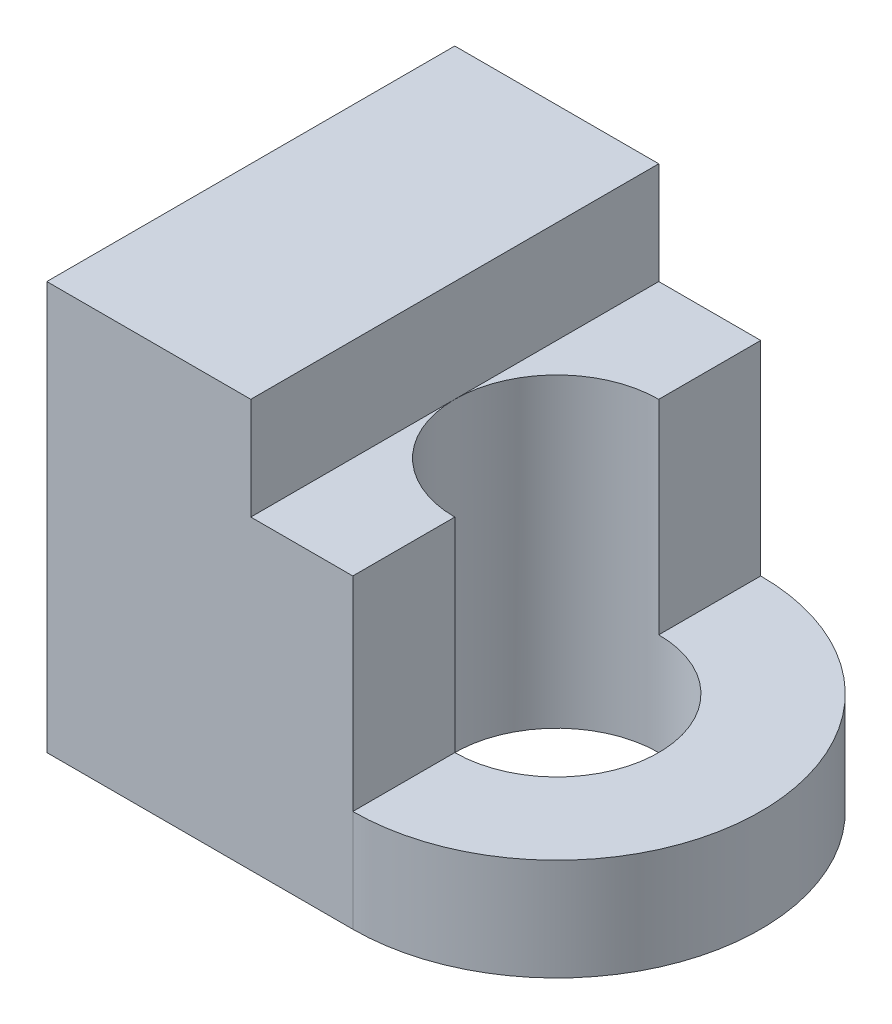
ISO-10303-21;
HEADER;
FILE_DESCRIPTION(('STEP AP214'),'2;1');
FILE_NAME('part.step','',(''),(''),'','','');
FILE_SCHEMA(('AUTOMOTIVE_DESIGN { 1 0 10303 214 1 1 1 1 }'));
ENDSEC;
DATA;
#1=APPLICATION_CONTEXT('core data for automotive mechanical design processes');
#2=APPLICATION_PROTOCOL_DEFINITION('international standard','automotive_design',2000,#1);
#3=PRODUCT_CONTEXT('',#1,'mechanical');
#4=PRODUCT('Part','Part','',(#3));
#5=PRODUCT_RELATED_PRODUCT_CATEGORY('part','',(#4));
#6=PRODUCT_DEFINITION_FORMATION('','',#4);
#7=PRODUCT_DEFINITION_CONTEXT('part definition',#1,'design');
#8=PRODUCT_DEFINITION('design','',#6,#7);
#9=PRODUCT_DEFINITION_SHAPE('','',#8);
#10=(LENGTH_UNIT() NAMED_UNIT(*) SI_UNIT(.MILLI.,.METRE.));
#11=(NAMED_UNIT(*) PLANE_ANGLE_UNIT() SI_UNIT($,.RADIAN.));
#12=(NAMED_UNIT(*) SI_UNIT($,.STERADIAN.) SOLID_ANGLE_UNIT());
#13=UNCERTAINTY_MEASURE_WITH_UNIT(LENGTH_MEASURE(1.E-05),#10,'distance_accuracy_value','');
#14=(GEOMETRIC_REPRESENTATION_CONTEXT(3) GLOBAL_UNCERTAINTY_ASSIGNED_CONTEXT((#13)) GLOBAL_UNIT_ASSIGNED_CONTEXT((#10,
#11,#12)) REPRESENTATION_CONTEXT('',''));
#15=CARTESIAN_POINT('',(0.,0.,0.));
#16=DIRECTION('',(0.,0.,1.));
#17=DIRECTION('',(1.,0.,0.));
#18=AXIS2_PLACEMENT_3D('',#15,#16,#17);
#19=CARTESIAN_POINT('',(0.,15.,0.));
#20=DIRECTION('',(0.,1.,0.));
#21=DIRECTION('',(0.,0.,1.));
#22=AXIS2_PLACEMENT_3D('',#19,#20,#21);
#23=PLANE('',#22);
#24=DIRECTION('',(-1.,0.,0.));
#25=VECTOR('',#24,1.);
#26=CARTESIAN_POINT('',(0.,15.,-10.));
#27=LINE('',#26,#25);
#28=CARTESIAN_POINT('',(0.,15.,-10.));
#29=VERTEX_POINT('',#28);
#30=CARTESIAN_POINT('',(-5.,15.,-10.));
#31=VERTEX_POINT('',#30);
#32=EDGE_CURVE('E75',#29,#31,#27,.T.);
#33=ORIENTED_EDGE('',*,*,#32,.T.);
#34=DIRECTION('',(0.,0.,1.));
#35=VECTOR('',#34,1.);
#36=CARTESIAN_POINT('',(-5.,15.,0.));
#37=LINE('',#36,#35);
#38=CARTESIAN_POINT('',(-5.,15.,0.));
#39=VERTEX_POINT('',#38);
#40=EDGE_CURVE('E12',#31,#39,#37,.T.);
#41=ORIENTED_EDGE('',*,*,#40,.T.);
#42=CARTESIAN_POINT('',(0.,15.,0.));
#43=DIRECTION('',(0.,1.,0.));
#44=DIRECTION('',(0.,0.,1.));
#45=AXIS2_PLACEMENT_3D('',#42,#43,#44);
#46=CIRCLE('',#45,5.);
#47=CARTESIAN_POINT('',(0.,15.,-5.));
#48=VERTEX_POINT('',#47);
#49=EDGE_CURVE('E162',#48,#39,#46,.T.);
#50=ORIENTED_EDGE('',*,*,#49,.F.);
#51=DIRECTION('',(0.,0.,-1.));
#52=VECTOR('',#51,1.);
#53=CARTESIAN_POINT('',(0.,15.,0.));
#54=LINE('',#53,#52);
#55=EDGE_CURVE('E165',#48,#29,#54,.T.);
#56=ORIENTED_EDGE('',*,*,#55,.T.);
#57=EDGE_LOOP('',(#33,#41,#50,#56));
#58=FACE_BOUND('',#57,.T.);
#59=ADVANCED_FACE('F54',(#58),#23,.T.);
#60=CARTESIAN_POINT('',(0.,15.,5.));
#61=VERTEX_POINT('',#60);
#62=EDGE_CURVE('E161',#39,#61,#46,.T.);
#63=ORIENTED_EDGE('',*,*,#62,.F.);
#64=CARTESIAN_POINT('',(-5.,15.,10.));
#65=VERTEX_POINT('',#64);
#66=EDGE_CURVE('E58',#39,#65,#37,.T.);
#67=ORIENTED_EDGE('',*,*,#66,.T.);
#68=DIRECTION('',(-1.,0.,0.));
#69=VECTOR('',#68,1.);
#70=CARTESIAN_POINT('',(0.,15.,10.));
#71=LINE('',#70,#69);
#72=CARTESIAN_POINT('',(0.,15.,10.));
#73=VERTEX_POINT('',#72);
#74=EDGE_CURVE('E168',#73,#65,#71,.T.);
#75=ORIENTED_EDGE('',*,*,#74,.F.);
#76=DIRECTION('',(0.,0.,1.));
#77=VECTOR('',#76,1.);
#78=CARTESIAN_POINT('',(0.,15.,0.));
#79=LINE('',#78,#77);
#80=EDGE_CURVE('E170',#61,#73,#79,.T.);
#81=ORIENTED_EDGE('',*,*,#80,.F.);
#82=EDGE_LOOP('',(#63,#67,#75,#81));
#83=FACE_BOUND('',#82,.T.);
#84=ADVANCED_FACE('F225',(#83),#23,.T.);
#85=CARTESIAN_POINT('',(0.,5.,0.));
#86=DIRECTION('',(0.,1.,0.));
#87=DIRECTION('',(0.,0.,1.));
#88=AXIS2_PLACEMENT_3D('',#85,#86,#87);
#89=PLANE('',#88);
#90=CARTESIAN_POINT('',(0.,5.,0.));
#91=DIRECTION('',(0.,1.,0.));
#92=DIRECTION('',(0.,0.,1.));
#93=AXIS2_PLACEMENT_3D('',#90,#91,#92);
#94=CIRCLE('',#93,10.);
#95=CARTESIAN_POINT('',(0.,5.,10.));
#96=VERTEX_POINT('',#95);
#97=CARTESIAN_POINT('',(0.,5.,-10.));
#98=VERTEX_POINT('',#97);
#99=EDGE_CURVE('E140',#96,#98,#94,.T.);
#100=ORIENTED_EDGE('',*,*,#99,.T.);
#101=DIRECTION('',(0.,0.,1.));
#102=VECTOR('',#101,1.);
#103=CARTESIAN_POINT('',(0.,5.,0.));
#104=LINE('',#103,#102);
#105=CARTESIAN_POINT('',(0.,5.,-5.));
#106=VERTEX_POINT('',#105);
#107=EDGE_CURVE('E188',#98,#106,#104,.T.);
#108=ORIENTED_EDGE('',*,*,#107,.T.);
#109=CARTESIAN_POINT('',(0.,5.,0.));
#110=DIRECTION('',(0.,1.,0.));
#111=DIRECTION('',(0.,0.,1.));
#112=AXIS2_PLACEMENT_3D('',#109,#110,#111);
#113=CIRCLE('',#112,5.);
#114=CARTESIAN_POINT('',(0.,5.,5.));
#115=VERTEX_POINT('',#114);
#116=EDGE_CURVE('E191',#115,#106,#113,.T.);
#117=ORIENTED_EDGE('',*,*,#116,.F.);
#118=DIRECTION('',(0.,0.,-1.));
#119=VECTOR('',#118,1.);
#120=CARTESIAN_POINT('',(0.,5.,0.));
#121=LINE('',#120,#119);
#122=EDGE_CURVE('E185',#96,#115,#121,.T.);
#123=ORIENTED_EDGE('',*,*,#122,.F.);
#124=EDGE_LOOP('',(#100,#108,#117,#123));
#125=FACE_BOUND('',#124,.T.);
#126=ADVANCED_FACE('F243',(#125),#89,.T.);
#127=CARTESIAN_POINT('',(0.,0.,0.));
#128=DIRECTION('',(0.,1.,0.));
#129=DIRECTION('',(0.,0.,1.));
#130=AXIS2_PLACEMENT_3D('',#127,#128,#129);
#131=PLANE('',#130);
#132=CARTESIAN_POINT('',(0.,0.,0.));
#133=DIRECTION('',(0.,1.,0.));
#134=DIRECTION('',(0.,0.,1.));
#135=AXIS2_PLACEMENT_3D('',#132,#133,#134);
#136=CIRCLE('',#135,5.);
#137=CARTESIAN_POINT('',(0.,0.,5.));
#138=VERTEX_POINT('',#137);
#139=EDGE_CURVE('E190',#138,#138,#136,.T.);
#140=ORIENTED_EDGE('',*,*,#139,.T.);
#141=EDGE_LOOP('',(#140));
#142=FACE_BOUND('',#141,.T.);
#143=DIRECTION('',(0.,0.,-1.));
#144=VECTOR('',#143,1.);
#145=CARTESIAN_POINT('',(-15.,0.,10.));
#146=LINE('',#145,#144);
#147=CARTESIAN_POINT('',(-15.,0.,10.));
#148=VERTEX_POINT('',#147);
#149=CARTESIAN_POINT('',(-15.,0.,-10.));
#150=VERTEX_POINT('',#149);
#151=EDGE_CURVE('E135',#148,#150,#146,.T.);
#152=ORIENTED_EDGE('',*,*,#151,.T.);
#153=DIRECTION('',(-1.,0.,0.));
#154=VECTOR('',#153,1.);
#155=CARTESIAN_POINT('',(0.,0.,-10.));
#156=LINE('',#155,#154);
#157=CARTESIAN_POINT('',(0.,0.,-10.));
#158=VERTEX_POINT('',#157);
#159=EDGE_CURVE('E201',#158,#150,#156,.T.);
#160=ORIENTED_EDGE('',*,*,#159,.F.);
#161=CARTESIAN_POINT('',(0.,0.,0.));
#162=DIRECTION('',(0.,1.,0.));
#163=DIRECTION('',(0.,0.,1.));
#164=AXIS2_PLACEMENT_3D('',#161,#162,#163);
#165=CIRCLE('',#164,10.);
#166=CARTESIAN_POINT('',(0.,0.,10.));
#167=VERTEX_POINT('',#166);
#168=EDGE_CURVE('E198',#167,#158,#165,.T.);
#169=ORIENTED_EDGE('',*,*,#168,.F.);
#170=DIRECTION('',(-1.,0.,0.));
#171=VECTOR('',#170,1.);
#172=CARTESIAN_POINT('',(0.,0.,10.));
#173=LINE('',#172,#171);
#174=EDGE_CURVE('E194',#167,#148,#173,.T.);
#175=ORIENTED_EDGE('',*,*,#174,.T.);
#176=EDGE_LOOP('',(#152,#160,#169,#175));
#177=FACE_BOUND('',#176,.T.);
#178=ADVANCED_FACE('F212',(#142,#177),#131,.F.);
#179=CARTESIAN_POINT('',(0.,5.,10.));
#180=DIRECTION('',(0.,0.,1.));
#181=DIRECTION('',(1.,0.,0.));
#182=AXIS2_PLACEMENT_3D('',#179,#180,#181);
#183=PLANE('',#182);
#184=DIRECTION('',(0.,-1.,0.));
#185=VECTOR('',#184,1.);
#186=CARTESIAN_POINT('',(-15.,5.,10.));
#187=LINE('',#186,#185);
#188=CARTESIAN_POINT('',(-15.,20.,10.));
#189=VERTEX_POINT('',#188);
#190=EDGE_CURVE('E129',#189,#148,#187,.T.);
#191=ORIENTED_EDGE('',*,*,#190,.T.);
#192=ORIENTED_EDGE('',*,*,#174,.F.);
#193=DIRECTION('',(0.,-1.,0.));
#194=VECTOR('',#193,1.);
#195=CARTESIAN_POINT('',(0.,5.,10.));
#196=LINE('',#195,#194);
#197=EDGE_CURVE('E204',#96,#167,#196,.T.);
#198=ORIENTED_EDGE('',*,*,#197,.F.);
#199=DIRECTION('',(0.,-1.,0.));
#200=VECTOR('',#199,1.);
#201=CARTESIAN_POINT('',(0.,15.,10.));
#202=LINE('',#201,#200);
#203=EDGE_CURVE('E176',#73,#96,#202,.T.);
#204=ORIENTED_EDGE('',*,*,#203,.F.);
#205=ORIENTED_EDGE('',*,*,#74,.T.);
#206=DIRECTION('',(0.,-1.,0.));
#207=VECTOR('',#206,1.);
#208=CARTESIAN_POINT('',(-5.,20.,10.));
#209=LINE('',#208,#207);
#210=CARTESIAN_POINT('',(-5.,20.,10.));
#211=VERTEX_POINT('',#210);
#212=EDGE_CURVE('E150',#211,#65,#209,.T.);
#213=ORIENTED_EDGE('',*,*,#212,.F.);
#214=DIRECTION('',(-1.,0.,0.));
#215=VECTOR('',#214,1.);
#216=CARTESIAN_POINT('',(0.,20.,10.));
#217=LINE('',#216,#215);
#218=EDGE_CURVE('E145',#211,#189,#217,.T.);
#219=ORIENTED_EDGE('',*,*,#218,.T.);
#220=EDGE_LOOP('',(#191,#192,#198,#204,#205,#213,#219));
#221=FACE_BOUND('',#220,.T.);
#222=ADVANCED_FACE('F56',(#221),#183,.T.);
#223=CARTESIAN_POINT('',(0.,5.,0.));
#224=DIRECTION('',(0.,-1.,0.));
#225=DIRECTION('',(0.,0.,-1.));
#226=AXIS2_PLACEMENT_3D('',#223,#224,#225);
#227=CYLINDRICAL_SURFACE('',#226,10.);
#228=ORIENTED_EDGE('',*,*,#168,.T.);
#229=DIRECTION('',(0.,-1.,0.));
#230=VECTOR('',#229,1.);
#231=CARTESIAN_POINT('',(0.,5.,-10.));
#232=LINE('',#231,#230);
#233=EDGE_CURVE('E206',#98,#158,#232,.T.);
#234=ORIENTED_EDGE('',*,*,#233,.F.);
#235=ORIENTED_EDGE('',*,*,#99,.F.);
#236=ORIENTED_EDGE('',*,*,#197,.T.);
#237=EDGE_LOOP('',(#228,#234,#235,#236));
#238=FACE_BOUND('',#237,.T.);
#239=ADVANCED_FACE('F218',(#238),#227,.T.);
#240=CARTESIAN_POINT('',(0.,5.,-10.));
#241=DIRECTION('',(0.,0.,1.));
#242=DIRECTION('',(1.,0.,0.));
#243=AXIS2_PLACEMENT_3D('',#240,#241,#242);
#244=PLANE('',#243);
#245=DIRECTION('',(0.,-1.,0.));
#246=VECTOR('',#245,1.);
#247=CARTESIAN_POINT('',(-15.,5.,-10.));
#248=LINE('',#247,#246);
#249=CARTESIAN_POINT('',(-15.,20.,-10.));
#250=VERTEX_POINT('',#249);
#251=EDGE_CURVE('E139',#250,#150,#248,.T.);
#252=ORIENTED_EDGE('',*,*,#251,.F.);
#253=DIRECTION('',(-1.,0.,0.));
#254=VECTOR('',#253,1.);
#255=CARTESIAN_POINT('',(0.,20.,-10.));
#256=LINE('',#255,#254);
#257=CARTESIAN_POINT('',(-5.,20.,-10.));
#258=VERTEX_POINT('',#257);
#259=EDGE_CURVE('E147',#258,#250,#256,.T.);
#260=ORIENTED_EDGE('',*,*,#259,.F.);
#261=DIRECTION('',(0.,-1.,0.));
#262=VECTOR('',#261,1.);
#263=CARTESIAN_POINT('',(-5.,20.,-10.));
#264=LINE('',#263,#262);
#265=EDGE_CURVE('E157',#258,#31,#264,.T.);
#266=ORIENTED_EDGE('',*,*,#265,.T.);
#267=ORIENTED_EDGE('',*,*,#32,.F.);
#268=DIRECTION('',(0.,-1.,0.));
#269=VECTOR('',#268,1.);
#270=CARTESIAN_POINT('',(0.,15.,-10.));
#271=LINE('',#270,#269);
#272=EDGE_CURVE('E179',#29,#98,#271,.T.);
#273=ORIENTED_EDGE('',*,*,#272,.T.);
#274=ORIENTED_EDGE('',*,*,#233,.T.);
#275=ORIENTED_EDGE('',*,*,#159,.T.);
#276=EDGE_LOOP('',(#252,#260,#266,#267,#273,#274,#275));
#277=FACE_BOUND('',#276,.T.);
#278=ADVANCED_FACE('F229',(#277),#244,.F.);
#279=CARTESIAN_POINT('',(-15.,5.,10.));
#280=DIRECTION('',(-1.,0.,0.));
#281=DIRECTION('',(0.,0.,1.));
#282=AXIS2_PLACEMENT_3D('',#279,#280,#281);
#283=PLANE('',#282);
#284=ORIENTED_EDGE('',*,*,#151,.F.);
#285=ORIENTED_EDGE('',*,*,#190,.F.);
#286=DIRECTION('',(0.,0.,-1.));
#287=VECTOR('',#286,1.);
#288=CARTESIAN_POINT('',(-15.,20.,0.));
#289=LINE('',#288,#287);
#290=EDGE_CURVE('E133',#189,#250,#289,.T.);
#291=ORIENTED_EDGE('',*,*,#290,.T.);
#292=ORIENTED_EDGE('',*,*,#251,.T.);
#293=EDGE_LOOP('',(#284,#285,#291,#292));
#294=FACE_BOUND('',#293,.T.);
#295=ADVANCED_FACE('F131',(#294),#283,.T.);
#296=CARTESIAN_POINT('',(0.,5.,0.));
#297=DIRECTION('',(0.,-1.,0.));
#298=DIRECTION('',(0.,0.,-1.));
#299=AXIS2_PLACEMENT_3D('',#296,#297,#298);
#300=CYLINDRICAL_SURFACE('',#299,5.);
#301=ORIENTED_EDGE('',*,*,#139,.F.);
#302=EDGE_LOOP('',(#301));
#303=FACE_BOUND('',#302,.T.);
#304=ORIENTED_EDGE('',*,*,#116,.T.);
#305=DIRECTION('',(0.,-1.,0.));
#306=VECTOR('',#305,1.);
#307=CARTESIAN_POINT('',(0.,15.,-5.));
#308=LINE('',#307,#306);
#309=EDGE_CURVE('E182',#48,#106,#308,.T.);
#310=ORIENTED_EDGE('',*,*,#309,.F.);
#311=ORIENTED_EDGE('',*,*,#49,.T.);
#312=ORIENTED_EDGE('',*,*,#62,.T.);
#313=DIRECTION('',(0.,-1.,0.));
#314=VECTOR('',#313,1.);
#315=CARTESIAN_POINT('',(0.,15.,5.));
#316=LINE('',#315,#314);
#317=EDGE_CURVE('E173',#61,#115,#316,.T.);
#318=ORIENTED_EDGE('',*,*,#317,.T.);
#319=EDGE_LOOP('',(#304,#310,#311,#312,#318));
#320=FACE_BOUND('',#319,.T.);
#321=ADVANCED_FACE('F236',(#303,#320),#300,.F.);
#322=CARTESIAN_POINT('',(0.,15.,0.));
#323=DIRECTION('',(-1.,0.,0.));
#324=DIRECTION('',(0.,0.,1.));
#325=AXIS2_PLACEMENT_3D('',#322,#323,#324);
#326=PLANE('',#325);
#327=ORIENTED_EDGE('',*,*,#107,.F.);
#328=ORIENTED_EDGE('',*,*,#272,.F.);
#329=ORIENTED_EDGE('',*,*,#55,.F.);
#330=ORIENTED_EDGE('',*,*,#309,.T.);
#331=EDGE_LOOP('',(#327,#328,#329,#330));
#332=FACE_BOUND('',#331,.T.);
#333=ADVANCED_FACE('F249',(#332),#326,.F.);
#334=CARTESIAN_POINT('',(0.,15.,0.));
#335=DIRECTION('',(1.,0.,0.));
#336=DIRECTION('',(0.,0.,-1.));
#337=AXIS2_PLACEMENT_3D('',#334,#335,#336);
#338=PLANE('',#337);
#339=ORIENTED_EDGE('',*,*,#203,.T.);
#340=ORIENTED_EDGE('',*,*,#122,.T.);
#341=ORIENTED_EDGE('',*,*,#317,.F.);
#342=ORIENTED_EDGE('',*,*,#80,.T.);
#343=EDGE_LOOP('',(#339,#340,#341,#342));
#344=FACE_BOUND('',#343,.T.);
#345=ADVANCED_FACE('F222',(#344),#338,.T.);
#346=CARTESIAN_POINT('',(-5.,20.,0.));
#347=DIRECTION('',(-1.,0.,0.));
#348=DIRECTION('',(0.,0.,1.));
#349=AXIS2_PLACEMENT_3D('',#346,#347,#348);
#350=PLANE('',#349);
#351=ORIENTED_EDGE('',*,*,#40,.F.);
#352=ORIENTED_EDGE('',*,*,#265,.F.);
#353=DIRECTION('',(0.,0.,-1.));
#354=VECTOR('',#353,1.);
#355=CARTESIAN_POINT('',(-5.,20.,0.));
#356=LINE('',#355,#354);
#357=EDGE_CURVE('E152',#211,#258,#356,.T.);
#358=ORIENTED_EDGE('',*,*,#357,.F.);
#359=ORIENTED_EDGE('',*,*,#212,.T.);
#360=ORIENTED_EDGE('',*,*,#66,.F.);
#361=EDGE_LOOP('',(#351,#352,#358,#359,#360));
#362=FACE_BOUND('',#361,.T.);
#363=ADVANCED_FACE('F227',(#362),#350,.F.);
#364=CARTESIAN_POINT('',(0.,20.,0.));
#365=DIRECTION('',(0.,1.,0.));
#366=DIRECTION('',(0.,0.,1.));
#367=AXIS2_PLACEMENT_3D('',#364,#365,#366);
#368=PLANE('',#367);
#369=ORIENTED_EDGE('',*,*,#290,.F.);
#370=ORIENTED_EDGE('',*,*,#218,.F.);
#371=ORIENTED_EDGE('',*,*,#357,.T.);
#372=ORIENTED_EDGE('',*,*,#259,.T.);
#373=EDGE_LOOP('',(#369,#370,#371,#372));
#374=FACE_BOUND('',#373,.T.);
#375=ADVANCED_FACE('F144',(#374),#368,.T.);
#376=CLOSED_SHELL('',(#59,#84,#126,#178,#222,#239,#278,#295,#321,#333,#345,#363,#375));
#377=MANIFOLD_SOLID_BREP('B2',#376);
#378=ADVANCED_BREP_SHAPE_REPRESENTATION('',(#18,#377),#14);
#379=SHAPE_DEFINITION_REPRESENTATION(#9,#378);
ENDSEC;
END-ISO-10303-21;
